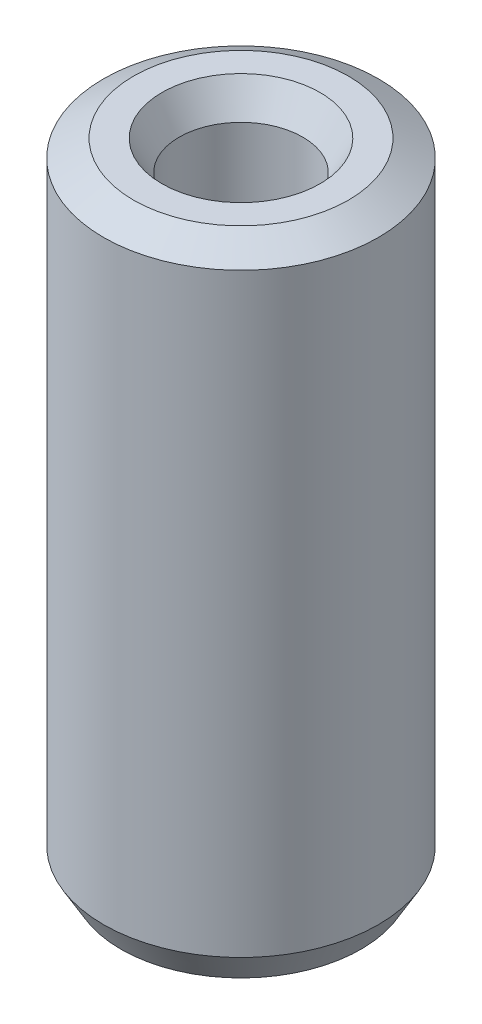
ISO-10303-21;
HEADER;
FILE_DESCRIPTION(('STEP AP214'),'2;1');
FILE_NAME('part.step','',(''),(''),'','','');
FILE_SCHEMA(('AUTOMOTIVE_DESIGN { 1 0 10303 214 1 1 1 1 }'));
ENDSEC;
DATA;
#1=APPLICATION_CONTEXT('core data for automotive mechanical design processes');
#2=APPLICATION_PROTOCOL_DEFINITION('international standard','automotive_design',2000,#1);
#3=PRODUCT_CONTEXT('',#1,'mechanical');
#4=PRODUCT('Part','Part','',(#3));
#5=PRODUCT_RELATED_PRODUCT_CATEGORY('part','',(#4));
#6=PRODUCT_DEFINITION_FORMATION('','',#4);
#7=PRODUCT_DEFINITION_CONTEXT('part definition',#1,'design');
#8=PRODUCT_DEFINITION('design','',#6,#7);
#9=PRODUCT_DEFINITION_SHAPE('','',#8);
#10=(LENGTH_UNIT() NAMED_UNIT(*) SI_UNIT(.MILLI.,.METRE.));
#11=(NAMED_UNIT(*) PLANE_ANGLE_UNIT() SI_UNIT($,.RADIAN.));
#12=(NAMED_UNIT(*) SI_UNIT($,.STERADIAN.) SOLID_ANGLE_UNIT());
#13=UNCERTAINTY_MEASURE_WITH_UNIT(LENGTH_MEASURE(1.E-05),#10,'distance_accuracy_value','');
#14=(GEOMETRIC_REPRESENTATION_CONTEXT(3) GLOBAL_UNCERTAINTY_ASSIGNED_CONTEXT((#13)) GLOBAL_UNIT_ASSIGNED_CONTEXT((#10,
#11,#12)) REPRESENTATION_CONTEXT('',''));
#15=CARTESIAN_POINT('',(0.,0.,0.));
#16=DIRECTION('',(0.,0.,1.));
#17=DIRECTION('',(1.,0.,0.));
#18=AXIS2_PLACEMENT_3D('',#15,#16,#17);
#19=CARTESIAN_POINT('',(0.,35.0571948901553,0.));
#20=DIRECTION('',(0.,-1.,0.));
#21=DIRECTION('',(0.,0.,-1.));
#22=AXIS2_PLACEMENT_3D('',#19,#20,#21);
#23=CYLINDRICAL_SURFACE('',#22,7.5);
#24=CARTESIAN_POINT('',(0.,1.63580675245443,0.));
#25=DIRECTION('',(0.,1.,0.));
#26=DIRECTION('',(0.,0.,1.));
#27=AXIS2_PLACEMENT_3D('',#24,#25,#26);
#28=CIRCLE('',#27,7.5);
#29=CARTESIAN_POINT('',(0.,1.63580675245442,-7.5));
#30=VERTEX_POINT('',#29);
#31=EDGE_CURVE('E10',#30,#30,#28,.T.);
#32=CARTESIAN_POINT('',(0.,34.1127614212835,0.));
#33=DIRECTION('',(0.,1.,0.));
#34=DIRECTION('',(0.,0.,1.));
#35=AXIS2_PLACEMENT_3D('',#32,#33,#34);
#36=CIRCLE('',#35,7.5);
#37=CARTESIAN_POINT('',(0.,34.1127614212835,-7.5));
#38=VERTEX_POINT('',#37);
#39=EDGE_CURVE('E50',#38,#38,#36,.F.);
#40=CARTESIAN_POINT('',(0.,1.63580675245442,-7.5));
#41=CARTESIAN_POINT('',(0.,1.97410836358806,-7.5));
#42=CARTESIAN_POINT('',(0.,2.31240997472169,-7.5));
#43=CARTESIAN_POINT('',(0.,2.98901319698897,-7.5));
#44=CARTESIAN_POINT('',(0.,3.32731480812261,-7.5));
#45=CARTESIAN_POINT('',(0.,4.00391803038988,-7.5));
#46=CARTESIAN_POINT('',(0.,4.34221964152351,-7.5));
#47=CARTESIAN_POINT('',(0.,5.01882286379078,-7.5));
#48=CARTESIAN_POINT('',(0.,5.35712447492442,-7.5));
#49=CARTESIAN_POINT('',(0.,6.03372769719169,-7.5));
#50=CARTESIAN_POINT('',(0.,6.37202930832533,-7.5));
#51=CARTESIAN_POINT('',(0.,7.0486325305926,-7.5));
#52=CARTESIAN_POINT('',(0.,7.38693414172624,-7.5));
#53=CARTESIAN_POINT('',(0.,8.06353736399351,-7.5));
#54=CARTESIAN_POINT('',(0.,8.40183897512715,-7.5));
#55=CARTESIAN_POINT('',(0.,9.07844219739443,-7.5));
#56=CARTESIAN_POINT('',(0.,9.41674380852806,-7.5));
#57=CARTESIAN_POINT('',(0.,10.0933470307953,-7.5));
#58=CARTESIAN_POINT('',(0.,10.431648641929,-7.5));
#59=CARTESIAN_POINT('',(0.,11.1082518641962,-7.5));
#60=CARTESIAN_POINT('',(0.,11.4465534753299,-7.5));
#61=CARTESIAN_POINT('',(0.,12.1231566975972,-7.5));
#62=CARTESIAN_POINT('',(0.,12.4614583087308,-7.5));
#63=CARTESIAN_POINT('',(0.,13.1380615309981,-7.5));
#64=CARTESIAN_POINT('',(0.,13.4763631421317,-7.5));
#65=CARTESIAN_POINT('',(0.,14.152966364399,-7.5));
#66=CARTESIAN_POINT('',(0.,14.4912679755326,-7.5));
#67=CARTESIAN_POINT('',(0.,15.1678711977999,-7.5));
#68=CARTESIAN_POINT('',(0.,15.5061728089335,-7.5));
#69=CARTESIAN_POINT('',(0.,16.1827760312008,-7.5));
#70=CARTESIAN_POINT('',(0.,16.5210776423344,-7.5));
#71=CARTESIAN_POINT('',(0.,17.1976808646017,-7.5));
#72=CARTESIAN_POINT('',(0.,17.5359824757353,-7.5));
#73=CARTESIAN_POINT('',(0.,18.2125856980026,-7.5));
#74=CARTESIAN_POINT('',(0.,18.5508873091363,-7.5));
#75=CARTESIAN_POINT('',(0.,19.2274905314035,-7.5));
#76=CARTESIAN_POINT('',(0.,19.5657921425372,-7.5));
#77=CARTESIAN_POINT('',(0.,20.2423953648044,-7.5));
#78=CARTESIAN_POINT('',(0.,20.5806969759381,-7.5));
#79=CARTESIAN_POINT('',(0.,21.2573001982053,-7.5));
#80=CARTESIAN_POINT('',(0.,21.595601809339,-7.5));
#81=CARTESIAN_POINT('',(0.,22.2722050316063,-7.5));
#82=CARTESIAN_POINT('',(0.,22.6105066427399,-7.5));
#83=CARTESIAN_POINT('',(0.,23.2871098650072,-7.5));
#84=CARTESIAN_POINT('',(0.,23.6254114761408,-7.5));
#85=CARTESIAN_POINT('',(0.,24.3020146984081,-7.5));
#86=CARTESIAN_POINT('',(0.,24.6403163095417,-7.5));
#87=CARTESIAN_POINT('',(0.,25.316919531809,-7.5));
#88=CARTESIAN_POINT('',(0.,25.6552211429426,-7.5));
#89=CARTESIAN_POINT('',(0.,26.3318243652099,-7.5));
#90=CARTESIAN_POINT('',(0.,26.6701259763435,-7.5));
#91=CARTESIAN_POINT('',(0.,27.3467291986108,-7.5));
#92=CARTESIAN_POINT('',(0.,27.6850308097444,-7.5));
#93=CARTESIAN_POINT('',(0.,28.3616340320117,-7.5));
#94=CARTESIAN_POINT('',(0.,28.6999356431453,-7.5));
#95=CARTESIAN_POINT('',(0.,29.3765388654126,-7.5));
#96=CARTESIAN_POINT('',(0.,29.7148404765463,-7.5));
#97=CARTESIAN_POINT('',(0.,30.3914436988135,-7.5));
#98=CARTESIAN_POINT('',(0.,30.7297453099472,-7.5));
#99=CARTESIAN_POINT('',(0.,31.4063485322144,-7.5));
#100=CARTESIAN_POINT('',(0.,31.7446501433481,-7.5));
#101=CARTESIAN_POINT('',(0.,32.4212533656154,-7.5));
#102=CARTESIAN_POINT('',(0.,32.759554976749,-7.5));
#103=CARTESIAN_POINT('',(0.,33.4361581990163,-7.5));
#104=CARTESIAN_POINT('',(0.,33.7744598101499,-7.5));
#105=CARTESIAN_POINT('',(0.,34.1127614212835,-7.5));
#106=B_SPLINE_CURVE_WITH_KNOTS('',3,(#40,#41,#42,#43,#44,#45,#46,#47,#48,#49,#50,#51,#52,#53,
#54,#55,#56,#57,#58,#59,#60,#61,#62,#63,#64,#65,#66,#67,#68,#69,#70,#71,#72,#73,#74,#75,#76,#77,
#78,#79,#80,#81,#82,#83,#84,#85,#86,#87,#88,#89,#90,#91,#92,#93,#94,#95,#96,#97,#98,#99,#100,
#101,#102,#103,#104,#105),.UNSPECIFIED.,.F.,.F.,(4,2,2,2,2,2,2,2,2,2,2,2,2,2,2,2,2,2,2,2,2,2,2,
2,2,2,2,2,2,2,2,2,4),(0.,1.01490483340091,2.02980966680182,3.04471450020273,4.05961933360364,
5.07452416700455,6.08942900040546,7.10433383380636,8.11923866720728,9.13414350060819,
10.1490483340091,11.16395316741,12.1788580008109,13.1937628342118,14.2086676676127,
15.2235725010136,16.2384773344146,17.2533821678155,18.2682870012164,19.2831918346173,
20.2980966680182,21.3130015014191,22.32790633482,23.3428111682209,24.3577160016218,
25.3726208350227,26.3875256684237,27.4024305018246,28.4173353352255,29.4322401686264,
30.4471450020273,31.4620498354282,32.4769546688291),.UNSPECIFIED.);
#107=EDGE_CURVE('BSEAM39',#30,#38,#106,.T.);
#108=ORIENTED_EDGE('',*,*,#31,.T.);
#109=ORIENTED_EDGE('',*,*,#39,.T.);
#110=ORIENTED_EDGE('',*,*,#107,.T.);
#111=ORIENTED_EDGE('',*,*,#107,.F.);
#112=EDGE_LOOP('',(#108,#110,#109,#111));
#113=FACE_BOUND('',#112,.T.);
#114=ADVANCED_FACE('F39',(#113),#23,.T.);
#115=CARTESIAN_POINT('',(0.,35.0571948901553,0.));
#116=DIRECTION('',(0.,1.,0.));
#117=DIRECTION('',(0.,0.,1.));
#118=AXIS2_PLACEMENT_3D('',#115,#116,#117);
#119=PLANE('',#118);
#120=CARTESIAN_POINT('',(0.,35.0571948901553,0.));
#121=DIRECTION('',(0.,1.,0.));
#122=DIRECTION('',(0.,0.,1.));
#123=AXIS2_PLACEMENT_3D('',#120,#121,#122);
#124=CIRCLE('',#123,4.31574622085751);
#125=CARTESIAN_POINT('',(0.,35.0571948901553,4.31574622085751));
#126=VERTEX_POINT('',#125);
#127=EDGE_CURVE('E58',#126,#126,#124,.F.);
#128=ORIENTED_EDGE('',*,*,#127,.T.);
#129=EDGE_LOOP('',(#128));
#130=FACE_BOUND('',#129,.T.);
#131=CARTESIAN_POINT('',(0.,35.0571948901553,0.));
#132=DIRECTION('',(0.,1.,0.));
#133=DIRECTION('',(0.,0.,1.));
#134=AXIS2_PLACEMENT_3D('',#131,#132,#133);
#135=CIRCLE('',#134,5.86419324754565);
#136=CARTESIAN_POINT('',(0.,35.0571948901553,-5.86419324754566));
#137=VERTEX_POINT('',#136);
#138=EDGE_CURVE('E61',#137,#137,#135,.T.);
#139=ORIENTED_EDGE('',*,*,#138,.T.);
#140=EDGE_LOOP('',(#139));
#141=FACE_BOUND('',#140,.T.);
#142=ADVANCED_FACE('F88',(#130,#141),#119,.T.);
#143=CARTESIAN_POINT('',(0.,0.,0.));
#144=DIRECTION('',(0.,1.,0.));
#145=DIRECTION('',(0.,0.,1.));
#146=AXIS2_PLACEMENT_3D('',#143,#144,#145);
#147=PLANE('',#146);
#148=CARTESIAN_POINT('',(0.,0.,0.));
#149=DIRECTION('',(0.,1.,0.));
#150=DIRECTION('',(0.,0.,1.));
#151=AXIS2_PLACEMENT_3D('',#148,#149,#150);
#152=CIRCLE('',#151,5.00711950444007);
#153=CARTESIAN_POINT('',(0.,0.,5.00711950444007));
#154=VERTEX_POINT('',#153);
#155=EDGE_CURVE('E51',#154,#154,#152,.T.);
#156=ORIENTED_EDGE('',*,*,#155,.T.);
#157=EDGE_LOOP('',(#156));
#158=FACE_BOUND('',#157,.T.);
#159=CARTESIAN_POINT('',(0.,0.,0.));
#160=DIRECTION('',(0.,1.,0.));
#161=DIRECTION('',(0.,0.,1.));
#162=AXIS2_PLACEMENT_3D('',#159,#160,#161);
#163=CIRCLE('',#162,6.55556653112822);
#164=CARTESIAN_POINT('',(0.,0.,6.55556653112822));
#165=VERTEX_POINT('',#164);
#166=EDGE_CURVE('E54',#165,#165,#163,.F.);
#167=ORIENTED_EDGE('',*,*,#166,.T.);
#168=EDGE_LOOP('',(#167));
#169=FACE_BOUND('',#168,.T.);
#170=ADVANCED_FACE('F83',(#158,#169),#147,.F.);
#171=CARTESIAN_POINT('',(0.,35.0571948901553,0.));
#172=DIRECTION('',(0.,-1.,0.));
#173=DIRECTION('',(0.,0.,-1.));
#174=AXIS2_PLACEMENT_3D('',#171,#172,#173);
#175=CYLINDRICAL_SURFACE('',#174,3.37131275198573);
#176=CARTESIAN_POINT('',(0.,33.4213881377008,0.));
#177=DIRECTION('',(0.,1.,0.));
#178=DIRECTION('',(0.,0.,1.));
#179=AXIS2_PLACEMENT_3D('',#176,#177,#178);
#180=CIRCLE('',#179,3.37131275198573);
#181=CARTESIAN_POINT('',(0.,33.4213881377008,-3.37131275198573));
#182=VERTEX_POINT('',#181);
#183=EDGE_CURVE('E67',#182,#182,#180,.T.);
#184=CARTESIAN_POINT('',(0.,0.944433468871735,0.));
#185=DIRECTION('',(0.,1.,0.));
#186=DIRECTION('',(0.,0.,1.));
#187=AXIS2_PLACEMENT_3D('',#184,#185,#186);
#188=CIRCLE('',#187,3.37131275198573);
#189=CARTESIAN_POINT('',(0.,0.944433468871728,-3.37131275198573));
#190=VERTEX_POINT('',#189);
#191=EDGE_CURVE('E69',#190,#190,#188,.F.);
#192=CARTESIAN_POINT('',(0.,33.4213881377008,-3.37131275198573));
#193=CARTESIAN_POINT('',(0.,33.0830865265672,-3.37131275198573));
#194=CARTESIAN_POINT('',(0.,32.7447849154336,-3.37131275198573));
#195=CARTESIAN_POINT('',(0.,32.0681816931663,-3.37131275198573));
#196=CARTESIAN_POINT('',(0.,31.7298800820327,-3.37131275198573));
#197=CARTESIAN_POINT('',(0.,31.0532768597654,-3.37131275198573));
#198=CARTESIAN_POINT('',(0.,30.7149752486317,-3.37131275198573));
#199=CARTESIAN_POINT('',(0.,30.0383720263645,-3.37131275198573));
#200=CARTESIAN_POINT('',(0.,29.7000704152308,-3.37131275198573));
#201=CARTESIAN_POINT('',(0.,29.0234671929636,-3.37131275198573));
#202=CARTESIAN_POINT('',(0.,28.6851655818299,-3.37131275198573));
#203=CARTESIAN_POINT('',(0.,28.0085623595627,-3.37131275198573));
#204=CARTESIAN_POINT('',(0.,27.670260748429,-3.37131275198573));
#205=CARTESIAN_POINT('',(0.,26.9936575261617,-3.37131275198573));
#206=CARTESIAN_POINT('',(0.,26.6553559150281,-3.37131275198573));
#207=CARTESIAN_POINT('',(0.,25.9787526927608,-3.37131275198573));
#208=CARTESIAN_POINT('',(0.,25.6404510816272,-3.37131275198573));
#209=CARTESIAN_POINT('',(0.,24.9638478593599,-3.37131275198573));
#210=CARTESIAN_POINT('',(0.,24.6255462482263,-3.37131275198573));
#211=CARTESIAN_POINT('',(0.,23.948943025959,-3.37131275198573));
#212=CARTESIAN_POINT('',(0.,23.6106414148254,-3.37131275198573));
#213=CARTESIAN_POINT('',(0.,22.9340381925581,-3.37131275198573));
#214=CARTESIAN_POINT('',(0.,22.5957365814245,-3.37131275198573));
#215=CARTESIAN_POINT('',(0.,21.9191333591572,-3.37131275198573));
#216=CARTESIAN_POINT('',(0.,21.5808317480236,-3.37131275198573));
#217=CARTESIAN_POINT('',(0.,20.9042285257563,-3.37131275198573));
#218=CARTESIAN_POINT('',(0.,20.5659269146226,-3.37131275198573));
#219=CARTESIAN_POINT('',(0.,19.8893236923554,-3.37131275198573));
#220=CARTESIAN_POINT('',(0.,19.5510220812217,-3.37131275198573));
#221=CARTESIAN_POINT('',(0.,18.8744188589545,-3.37131275198573));
#222=CARTESIAN_POINT('',(0.,18.5361172478208,-3.37131275198573));
#223=CARTESIAN_POINT('',(0.,17.8595140255536,-3.37131275198573));
#224=CARTESIAN_POINT('',(0.,17.5212124144199,-3.37131275198573));
#225=CARTESIAN_POINT('',(0.,16.8446091921526,-3.37131275198573));
#226=CARTESIAN_POINT('',(0.,16.506307581019,-3.37131275198573));
#227=CARTESIAN_POINT('',(0.,15.8297043587517,-3.37131275198573));
#228=CARTESIAN_POINT('',(0.,15.4914027476181,-3.37131275198573));
#229=CARTESIAN_POINT('',(0.,14.8147995253508,-3.37131275198573));
#230=CARTESIAN_POINT('',(0.,14.4764979142172,-3.37131275198573));
#231=CARTESIAN_POINT('',(0.,13.7998946919499,-3.37131275198573));
#232=CARTESIAN_POINT('',(0.,13.4615930808163,-3.37131275198573));
#233=CARTESIAN_POINT('',(0.,12.784989858549,-3.37131275198573));
#234=CARTESIAN_POINT('',(0.,12.4466882474154,-3.37131275198573));
#235=CARTESIAN_POINT('',(0.,11.7700850251481,-3.37131275198573));
#236=CARTESIAN_POINT('',(0.,11.4317834140145,-3.37131275198573));
#237=CARTESIAN_POINT('',(0.,10.7551801917472,-3.37131275198573));
#238=CARTESIAN_POINT('',(0.,10.4168785806135,-3.37131275198573));
#239=CARTESIAN_POINT('',(0.,9.74027535834627,-3.37131275198573));
#240=CARTESIAN_POINT('',(0.,9.40197374721264,-3.37131275198573));
#241=CARTESIAN_POINT('',(0.,8.72537052494536,-3.37131275198573));
#242=CARTESIAN_POINT('',(0.,8.38706891381173,-3.37131275198573));
#243=CARTESIAN_POINT('',(0.,7.71046569154445,-3.37131275198573));
#244=CARTESIAN_POINT('',(0.,7.37216408041082,-3.37131275198573));
#245=CARTESIAN_POINT('',(0.,6.69556085814355,-3.37131275198573));
#246=CARTESIAN_POINT('',(0.,6.35725924700991,-3.37131275198573));
#247=CARTESIAN_POINT('',(0.,5.68065602474263,-3.37131275198573));
#248=CARTESIAN_POINT('',(0.,5.342354413609,-3.37131275198573));
#249=CARTESIAN_POINT('',(0.,4.66575119134172,-3.37131275198573));
#250=CARTESIAN_POINT('',(0.,4.32744958020809,-3.37131275198573));
#251=CARTESIAN_POINT('',(0.,3.65084635794082,-3.37131275198573));
#252=CARTESIAN_POINT('',(0.,3.31254474680718,-3.37131275198573));
#253=CARTESIAN_POINT('',(0.,2.6359415245399,-3.37131275198573));
#254=CARTESIAN_POINT('',(0.,2.29763991340627,-3.37131275198573));
#255=CARTESIAN_POINT('',(0.,1.62103669113899,-3.37131275198573));
#256=CARTESIAN_POINT('',(0.,1.28273508000536,-3.37131275198573));
#257=CARTESIAN_POINT('',(0.,0.944433468871728,-3.37131275198573));
#258=B_SPLINE_CURVE_WITH_KNOTS('',3,(#192,#193,#194,#195,#196,#197,#198,#199,#200,#201,#202,
#203,#204,#205,#206,#207,#208,#209,#210,#211,#212,#213,#214,#215,#216,#217,#218,#219,#220,#221,
#222,#223,#224,#225,#226,#227,#228,#229,#230,#231,#232,#233,#234,#235,#236,#237,#238,#239,#240,
#241,#242,#243,#244,#245,#246,#247,#248,#249,#250,#251,#252,#253,#254,#255,#256,#257),
.UNSPECIFIED.,.F.,.F.,(4,2,2,2,2,2,2,2,2,2,2,2,2,2,2,2,2,2,2,2,2,2,2,2,2,2,2,2,2,2,2,2,4),(0.,
1.01490483340091,2.02980966680182,3.04471450020273,4.05961933360364,5.07452416700455,
6.08942900040546,7.10433383380637,8.11923866720728,9.13414350060819,10.1490483340091,
11.16395316741,12.1788580008109,13.1937628342118,14.2086676676127,15.2235725010136,
16.2384773344146,17.2533821678155,18.2682870012164,19.2831918346173,20.2980966680182,
21.3130015014191,22.32790633482,23.3428111682209,24.3577160016218,25.3726208350228,
26.3875256684237,27.4024305018246,28.4173353352255,29.4322401686264,30.4471450020273,
31.4620498354282,32.4769546688291),.UNSPECIFIED.);
#259=EDGE_CURVE('BSEAM71',#182,#190,#258,.T.);
#260=ORIENTED_EDGE('',*,*,#183,.T.);
#261=ORIENTED_EDGE('',*,*,#191,.T.);
#262=ORIENTED_EDGE('',*,*,#259,.T.);
#263=ORIENTED_EDGE('',*,*,#259,.F.);
#264=EDGE_LOOP('',(#260,#262,#261,#263));
#265=FACE_BOUND('',#264,.T.);
#266=ADVANCED_FACE('F71',(#265),#175,.F.);
#267=CARTESIAN_POINT('',(0.,33.4213881377008,0.));
#268=DIRECTION('',(0.,1.,0.));
#269=DIRECTION('',(0.,0.,1.));
#270=AXIS2_PLACEMENT_3D('',#267,#268,#269);
#271=CONICAL_SURFACE('',#270,3.37131275198573,0.523598775598301);
#272=ORIENTED_EDGE('',*,*,#127,.F.);
#273=EDGE_LOOP('',(#272));
#274=FACE_BOUND('',#273,.T.);
#275=ORIENTED_EDGE('',*,*,#183,.F.);
#276=EDGE_LOOP('',(#275));
#277=FACE_BOUND('',#276,.T.);
#278=ADVANCED_FACE('F77',(#274,#277),#271,.F.);
#279=CARTESIAN_POINT('',(0.,0.,0.));
#280=DIRECTION('',(0.,-1.,0.));
#281=DIRECTION('',(0.,0.,-1.));
#282=AXIS2_PLACEMENT_3D('',#279,#280,#281);
#283=CONICAL_SURFACE('',#282,5.00711950444007,1.04719755119659);
#284=ORIENTED_EDGE('',*,*,#191,.F.);
#285=EDGE_LOOP('',(#284));
#286=FACE_BOUND('',#285,.T.);
#287=ORIENTED_EDGE('',*,*,#155,.F.);
#288=EDGE_LOOP('',(#287));
#289=FACE_BOUND('',#288,.T.);
#290=ADVANCED_FACE('F73',(#286,#289),#283,.F.);
#291=CARTESIAN_POINT('',(0.,1.63580675245443,0.));
#292=DIRECTION('',(0.,1.,0.));
#293=DIRECTION('',(0.,0.,1.));
#294=AXIS2_PLACEMENT_3D('',#291,#292,#293);
#295=CONICAL_SURFACE('',#294,7.5,0.523598775598303);
#296=ORIENTED_EDGE('',*,*,#166,.F.);
#297=EDGE_LOOP('',(#296));
#298=FACE_BOUND('',#297,.T.);
#299=ORIENTED_EDGE('',*,*,#31,.F.);
#300=EDGE_LOOP('',(#299));
#301=FACE_BOUND('',#300,.T.);
#302=ADVANCED_FACE('F76',(#298,#301),#295,.T.);
#303=CARTESIAN_POINT('',(0.,35.0571948901553,0.));
#304=DIRECTION('',(0.,-1.,0.));
#305=DIRECTION('',(0.,0.,-1.));
#306=AXIS2_PLACEMENT_3D('',#303,#304,#305);
#307=CONICAL_SURFACE('',#306,5.86419324754565,1.0471975511966);
#308=CARTESIAN_POINT('',(0.,34.1127614212835,-7.50000000000001));
#309=CARTESIAN_POINT('',(0.,34.1225992699176,-7.48296034632861));
#310=CARTESIAN_POINT('',(0.,34.1324371185517,-7.46592069265721));
#311=CARTESIAN_POINT('',(0.,34.1521128158198,-7.43184138531441));
#312=CARTESIAN_POINT('',(0.,34.1619506644539,-7.41480173164301));
#313=CARTESIAN_POINT('',(0.,34.1816263617221,-7.38072242430021));
#314=CARTESIAN_POINT('',(0.,34.1914642103562,-7.36368277062881));
#315=CARTESIAN_POINT('',(0.,34.2111399076243,-7.32960346328601));
#316=CARTESIAN_POINT('',(0.,34.2209777562584,-7.31256380961461));
#317=CARTESIAN_POINT('',(0.,34.2406534535266,-7.27848450227181));
#318=CARTESIAN_POINT('',(0.,34.2504913021607,-7.26144484860041));
#319=CARTESIAN_POINT('',(0.,34.2701669994288,-7.22736554125761));
#320=CARTESIAN_POINT('',(0.,34.2800048480629,-7.21032588758622));
#321=CARTESIAN_POINT('',(0.,34.2996805453311,-7.17624658024342));
#322=CARTESIAN_POINT('',(0.,34.3095183939651,-7.15920692657202));
#323=CARTESIAN_POINT('',(0.,34.3291940912333,-7.12512761922922));
#324=CARTESIAN_POINT('',(0.,34.3390319398674,-7.10808796555782));
#325=CARTESIAN_POINT('',(0.,34.3587076371355,-7.07400865821502));
#326=CARTESIAN_POINT('',(0.,34.3685454857696,-7.05696900454362));
#327=CARTESIAN_POINT('',(0.,34.3882211830378,-7.02288969720082));
#328=CARTESIAN_POINT('',(0.,34.3980590316719,-7.00585004352942));
#329=CARTESIAN_POINT('',(0.,34.41773472894,-6.97177073618662));
#330=CARTESIAN_POINT('',(0.,34.4275725775741,-6.95473108251522));
#331=CARTESIAN_POINT('',(0.,34.4472482748423,-6.92065177517242));
#332=CARTESIAN_POINT('',(0.,34.4570861234764,-6.90361212150103));
#333=CARTESIAN_POINT('',(0.,34.4767618207445,-6.86953281415823));
#334=CARTESIAN_POINT('',(0.,34.4865996693786,-6.85249316048683));
#335=CARTESIAN_POINT('',(0.,34.5062753666467,-6.81841385314403));
#336=CARTESIAN_POINT('',(0.,34.5161132152808,-6.80137419947263));
#337=CARTESIAN_POINT('',(0.,34.535788912549,-6.76729489212983));
#338=CARTESIAN_POINT('',(0.,34.5456267611831,-6.75025523845843));
#339=CARTESIAN_POINT('',(0.,34.5653024584512,-6.71617593111563));
#340=CARTESIAN_POINT('',(0.,34.5751403070853,-6.69913627744423));
#341=CARTESIAN_POINT('',(0.,34.5948160043535,-6.66505697010143));
#342=CARTESIAN_POINT('',(0.,34.6046538529876,-6.64801731643003));
#343=CARTESIAN_POINT('',(0.,34.6243295502557,-6.61393800908723));
#344=CARTESIAN_POINT('',(0.,34.6341673988898,-6.59689835541583));
#345=CARTESIAN_POINT('',(0.,34.653843096158,-6.56281904807304));
#346=CARTESIAN_POINT('',(0.,34.663680944792,-6.54577939440164));
#347=CARTESIAN_POINT('',(0.,34.6833566420602,-6.51170008705884));
#348=CARTESIAN_POINT('',(0.,34.6931944906943,-6.49466043338744));
#349=CARTESIAN_POINT('',(0.,34.7128701879624,-6.46058112604464));
#350=CARTESIAN_POINT('',(0.,34.7227080365965,-6.44354147237324));
#351=CARTESIAN_POINT('',(0.,34.7423837338647,-6.40946216503044));
#352=CARTESIAN_POINT('',(0.,34.7522215824988,-6.39242251135904));
#353=CARTESIAN_POINT('',(0.,34.7718972797669,-6.35834320401624));
#354=CARTESIAN_POINT('',(0.,34.781735128401,-6.34130355034484));
#355=CARTESIAN_POINT('',(0.,34.8014108256692,-6.30722424300204));
#356=CARTESIAN_POINT('',(0.,34.8112486743033,-6.29018458933064));
#357=CARTESIAN_POINT('',(0.,34.8309243715714,-6.25610528198785));
#358=CARTESIAN_POINT('',(0.,34.8407622202055,-6.23906562831645));
#359=CARTESIAN_POINT('',(0.,34.8604379174736,-6.20498632097365));
#360=CARTESIAN_POINT('',(0.,34.8702757661077,-6.18794666730225));
#361=CARTESIAN_POINT('',(0.,34.8899514633759,-6.15386735995945));
#362=CARTESIAN_POINT('',(0.,34.89978931201,-6.13682770628805));
#363=CARTESIAN_POINT('',(0.,34.9194650092781,-6.10274839894525));
#364=CARTESIAN_POINT('',(0.,34.9293028579122,-6.08570874527385));
#365=CARTESIAN_POINT('',(0.,34.9489785551804,-6.05162943793105));
#366=CARTESIAN_POINT('',(0.,34.9588164038145,-6.03458978425965));
#367=CARTESIAN_POINT('',(0.,34.9784921010826,-6.00051047691685));
#368=CARTESIAN_POINT('',(0.,34.9883299497167,-5.98347082324545));
#369=CARTESIAN_POINT('',(0.,35.0080056469849,-5.94939151590266));
#370=CARTESIAN_POINT('',(0.,35.0178434956189,-5.93235186223126));
#371=CARTESIAN_POINT('',(0.,35.0375191928871,-5.89827255488846));
#372=CARTESIAN_POINT('',(0.,35.0473570415212,-5.88123290121706));
#373=CARTESIAN_POINT('',(0.,35.0571948901553,-5.86419324754566));
#374=B_SPLINE_CURVE_WITH_KNOTS('',3,(#308,#309,#310,#311,#312,#313,#314,#315,#316,#317,#318,
#319,#320,#321,#322,#323,#324,#325,#326,#327,#328,#329,#330,#331,#332,#333,#334,#335,#336,#337,
#338,#339,#340,#341,#342,#343,#344,#345,#346,#347,#348,#349,#350,#351,#352,#353,#354,#355,#356,
#357,#358,#359,#360,#361,#362,#363,#364,#365,#366,#367,#368,#369,#370,#371,#372,#373),
.UNSPECIFIED.,.F.,.F.,(4,2,2,2,2,2,2,2,2,2,2,2,2,2,2,2,2,2,2,2,2,2,2,2,2,2,2,2,2,2,2,2,4),(0.,
0.0590270918044794,0.118054183608963,0.177081275413446,0.236108367217929,0.295135459022411,
0.354162550826895,0.413189642631378,0.472216734435861,0.531243826240344,0.590270918044827,
0.64929800984931,0.708325101653794,0.767352193458276,0.826379285262759,0.885406377067243,
0.944433468871726,1.00346056067621,1.06248765248069,1.12151474428517,1.18054183608965,
1.23956892789414,1.29859601969862,1.3576231115031,1.41665020330759,1.47567729511207,
1.53470438691655,1.59373147872104,1.65275857052552,1.71178566233,1.77081275413448,
1.82983984593897,1.88886693774345),.UNSPECIFIED.);
#375=EDGE_CURVE('BSEAM45',#38,#137,#374,.T.);
#376=ORIENTED_EDGE('',*,*,#39,.F.);
#377=ORIENTED_EDGE('',*,*,#138,.F.);
#378=ORIENTED_EDGE('',*,*,#375,.T.);
#379=ORIENTED_EDGE('',*,*,#375,.F.);
#380=EDGE_LOOP('',(#376,#378,#377,#379));
#381=FACE_BOUND('',#380,.T.);
#382=ADVANCED_FACE('F45',(#381),#307,.T.);
#383=CLOSED_SHELL('',(#114,#142,#170,#266,#278,#290,#302,#382));
#384=MANIFOLD_SOLID_BREP('B2',#383);
#385=ADVANCED_BREP_SHAPE_REPRESENTATION('',(#18,#384),#14);
#386=SHAPE_DEFINITION_REPRESENTATION(#9,#385);
ENDSEC;
END-ISO-10303-21;
